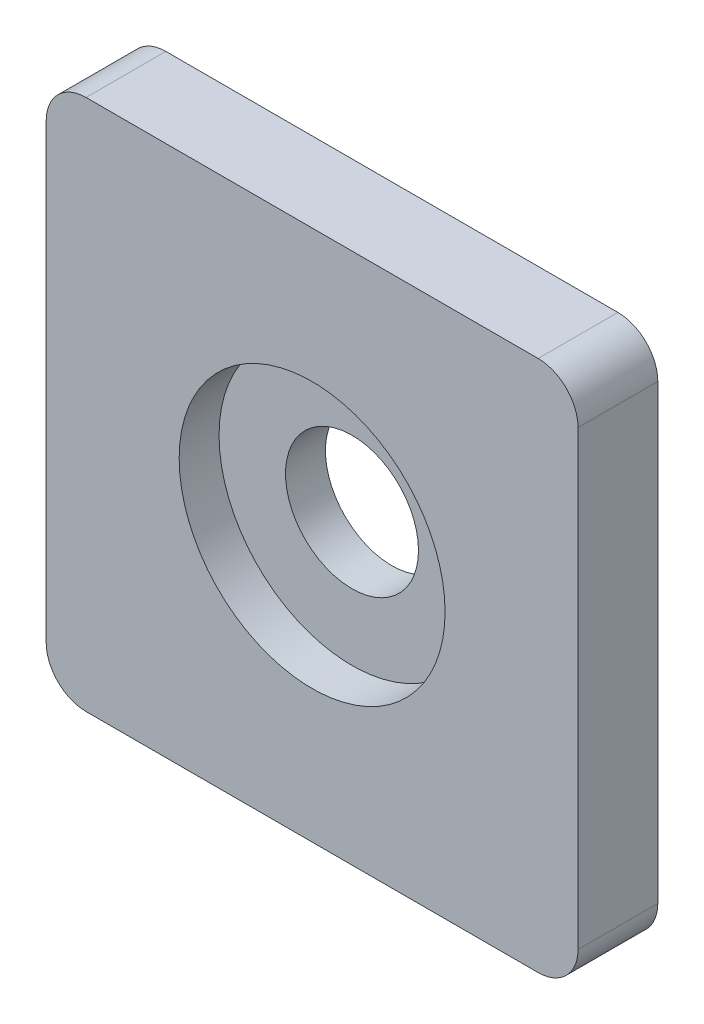
ISO-10303-21;
HEADER;
FILE_DESCRIPTION(('STEP AP214'),'2;1');
FILE_NAME('part.step','',(''),(''),'','','');
FILE_SCHEMA(('AUTOMOTIVE_DESIGN { 1 0 10303 214 1 1 1 1 }'));
ENDSEC;
DATA;
#1=APPLICATION_CONTEXT('core data for automotive mechanical design processes');
#2=APPLICATION_PROTOCOL_DEFINITION('international standard','automotive_design',2000,#1);
#3=PRODUCT_CONTEXT('',#1,'mechanical');
#4=PRODUCT('Part','Part','',(#3));
#5=PRODUCT_RELATED_PRODUCT_CATEGORY('part','',(#4));
#6=PRODUCT_DEFINITION_FORMATION('','',#4);
#7=PRODUCT_DEFINITION_CONTEXT('part definition',#1,'design');
#8=PRODUCT_DEFINITION('design','',#6,#7);
#9=PRODUCT_DEFINITION_SHAPE('','',#8);
#10=(LENGTH_UNIT() NAMED_UNIT(*) SI_UNIT(.MILLI.,.METRE.));
#11=(NAMED_UNIT(*) PLANE_ANGLE_UNIT() SI_UNIT($,.RADIAN.));
#12=(NAMED_UNIT(*) SI_UNIT($,.STERADIAN.) SOLID_ANGLE_UNIT());
#13=UNCERTAINTY_MEASURE_WITH_UNIT(LENGTH_MEASURE(1.E-05),#10,'distance_accuracy_value','');
#14=(GEOMETRIC_REPRESENTATION_CONTEXT(3) GLOBAL_UNCERTAINTY_ASSIGNED_CONTEXT((#13)) GLOBAL_UNIT_ASSIGNED_CONTEXT((#10,
#11,#12)) REPRESENTATION_CONTEXT('',''));
#15=CARTESIAN_POINT('',(0.,0.,0.));
#16=DIRECTION('',(0.,0.,1.));
#17=DIRECTION('',(1.,0.,0.));
#18=AXIS2_PLACEMENT_3D('',#15,#16,#17);
#19=CARTESIAN_POINT('',(0.,0.,1.5));
#20=DIRECTION('',(0.,0.,-1.));
#21=DIRECTION('',(-1.,0.,0.));
#22=AXIS2_PLACEMENT_3D('',#19,#20,#21);
#23=CYLINDRICAL_SURFACE('',#22,2.5);
#24=CARTESIAN_POINT('',(0.,0.,-1.5));
#25=DIRECTION('',(0.,0.,1.));
#26=DIRECTION('',(1.,0.,0.));
#27=AXIS2_PLACEMENT_3D('',#24,#25,#26);
#28=CIRCLE('',#27,2.5);
#29=CARTESIAN_POINT('',(2.5,0.,-1.5));
#30=VERTEX_POINT('',#29);
#31=EDGE_CURVE('E135',#30,#30,#28,.T.);
#32=ORIENTED_EDGE('',*,*,#31,.F.);
#33=EDGE_LOOP('',(#32));
#34=FACE_BOUND('',#33,.T.);
#35=CARTESIAN_POINT('',(0.,0.,0.));
#36=DIRECTION('',(0.,0.,1.));
#37=DIRECTION('',(1.,0.,0.));
#38=AXIS2_PLACEMENT_3D('',#35,#36,#37);
#39=CIRCLE('',#38,2.5);
#40=CARTESIAN_POINT('',(2.5,0.,0.));
#41=VERTEX_POINT('',#40);
#42=EDGE_CURVE('E37',#41,#41,#39,.T.);
#43=ORIENTED_EDGE('',*,*,#42,.T.);
#44=EDGE_LOOP('',(#43));
#45=FACE_BOUND('',#44,.T.);
#46=ADVANCED_FACE('F33',(#34,#45),#23,.F.);
#47=CARTESIAN_POINT('',(-8.50000000000001,-8.50000000000001,1.5));
#48=DIRECTION('',(0.,0.,-1.));
#49=DIRECTION('',(-1.,0.,0.));
#50=AXIS2_PLACEMENT_3D('',#47,#48,#49);
#51=PLANE('',#50);
#52=CARTESIAN_POINT('',(0.,0.,1.5));
#53=DIRECTION('',(0.,0.,1.));
#54=DIRECTION('',(1.,0.,0.));
#55=AXIS2_PLACEMENT_3D('',#52,#53,#54);
#56=CIRCLE('',#55,5.);
#57=CARTESIAN_POINT('',(4.99999999999999,0.,1.5));
#58=VERTEX_POINT('',#57);
#59=EDGE_CURVE('E186',#58,#58,#56,.T.);
#60=ORIENTED_EDGE('',*,*,#59,.F.);
#61=EDGE_LOOP('',(#60));
#62=FACE_BOUND('',#61,.T.);
#63=CARTESIAN_POINT('',(-8.50000000000001,-8.50000000000001,1.5));
#64=DIRECTION('',(0.,0.,1.));
#65=DIRECTION('',(-1.,0.,0.));
#66=AXIS2_PLACEMENT_3D('',#63,#64,#65);
#67=CIRCLE('',#66,1.5);
#68=CARTESIAN_POINT('',(-10.,-8.5,1.5));
#69=VERTEX_POINT('',#68);
#70=CARTESIAN_POINT('',(-8.5,-10.,1.5));
#71=VERTEX_POINT('',#70);
#72=EDGE_CURVE('E146',#69,#71,#67,.T.);
#73=ORIENTED_EDGE('',*,*,#72,.T.);
#74=DIRECTION('',(1.,0.,0.));
#75=VECTOR('',#74,1.);
#76=CARTESIAN_POINT('',(-8.5,-10.,1.5));
#77=LINE('',#76,#75);
#78=CARTESIAN_POINT('',(8.49999999999999,-10.,1.5));
#79=VERTEX_POINT('',#78);
#80=EDGE_CURVE('E94',#71,#79,#77,.T.);
#81=ORIENTED_EDGE('',*,*,#80,.T.);
#82=CARTESIAN_POINT('',(8.49999999999999,-8.5,1.5));
#83=DIRECTION('',(0.,0.,1.));
#84=DIRECTION('',(1.,0.,0.));
#85=AXIS2_PLACEMENT_3D('',#82,#83,#84);
#86=CIRCLE('',#85,1.5);
#87=CARTESIAN_POINT('',(9.99999999999999,-8.49999999999999,1.5));
#88=VERTEX_POINT('',#87);
#89=EDGE_CURVE('E162',#79,#88,#86,.T.);
#90=ORIENTED_EDGE('',*,*,#89,.T.);
#91=DIRECTION('',(0.,1.,0.));
#92=VECTOR('',#91,1.);
#93=CARTESIAN_POINT('',(9.99999999999999,-8.49999999999999,1.5));
#94=LINE('',#93,#92);
#95=CARTESIAN_POINT('',(9.99999999999999,8.49999999999999,1.5));
#96=VERTEX_POINT('',#95);
#97=EDGE_CURVE('E175',#88,#96,#94,.T.);
#98=ORIENTED_EDGE('',*,*,#97,.T.);
#99=CARTESIAN_POINT('',(8.49999999999999,8.49999999999999,1.5));
#100=DIRECTION('',(0.,0.,1.));
#101=DIRECTION('',(-1.,0.,0.));
#102=AXIS2_PLACEMENT_3D('',#99,#100,#101);
#103=CIRCLE('',#102,1.5);
#104=CARTESIAN_POINT('',(8.49999999999999,9.99999999999999,1.5));
#105=VERTEX_POINT('',#104);
#106=EDGE_CURVE('E113',#96,#105,#103,.T.);
#107=ORIENTED_EDGE('',*,*,#106,.T.);
#108=DIRECTION('',(-1.,0.,0.));
#109=VECTOR('',#108,1.);
#110=CARTESIAN_POINT('',(-8.5,9.99999999999999,1.5));
#111=LINE('',#110,#109);
#112=CARTESIAN_POINT('',(-8.5,9.99999999999999,1.5));
#113=VERTEX_POINT('',#112);
#114=EDGE_CURVE('E107',#105,#113,#111,.T.);
#115=ORIENTED_EDGE('',*,*,#114,.T.);
#116=CARTESIAN_POINT('',(-8.50000000000001,8.49999999999999,1.5));
#117=DIRECTION('',(0.,0.,1.));
#118=DIRECTION('',(-1.,0.,0.));
#119=AXIS2_PLACEMENT_3D('',#116,#117,#118);
#120=CIRCLE('',#119,1.5);
#121=CARTESIAN_POINT('',(-10.,8.49999999999999,1.5));
#122=VERTEX_POINT('',#121);
#123=EDGE_CURVE('E111',#113,#122,#120,.T.);
#124=ORIENTED_EDGE('',*,*,#123,.T.);
#125=DIRECTION('',(0.,-1.,0.));
#126=VECTOR('',#125,1.);
#127=CARTESIAN_POINT('',(-10.,-8.5,1.5));
#128=LINE('',#127,#126);
#129=EDGE_CURVE('E51',#122,#69,#128,.T.);
#130=ORIENTED_EDGE('',*,*,#129,.T.);
#131=EDGE_LOOP('',(#73,#81,#90,#98,#107,#115,#124,#130));
#132=FACE_BOUND('',#131,.T.);
#133=ADVANCED_FACE('F109',(#62,#132),#51,.F.);
#134=CARTESIAN_POINT('',(-8.50000000000001,-8.50000000000001,-1.5));
#135=DIRECTION('',(0.,0.,-1.));
#136=DIRECTION('',(-1.,0.,0.));
#137=AXIS2_PLACEMENT_3D('',#134,#135,#136);
#138=PLANE('',#137);
#139=CARTESIAN_POINT('',(-8.50000000000001,-8.50000000000001,-1.5));
#140=DIRECTION('',(0.,0.,1.));
#141=DIRECTION('',(-1.,0.,0.));
#142=AXIS2_PLACEMENT_3D('',#139,#140,#141);
#143=CIRCLE('',#142,1.5);
#144=CARTESIAN_POINT('',(-10.,-8.5,-1.5));
#145=VERTEX_POINT('',#144);
#146=CARTESIAN_POINT('',(-8.5,-10.,-1.5));
#147=VERTEX_POINT('',#146);
#148=EDGE_CURVE('E131',#145,#147,#143,.T.);
#149=ORIENTED_EDGE('',*,*,#148,.F.);
#150=DIRECTION('',(0.,-1.,0.));
#151=VECTOR('',#150,1.);
#152=CARTESIAN_POINT('',(-10.,-8.5,-1.5));
#153=LINE('',#152,#151);
#154=CARTESIAN_POINT('',(-10.,8.49999999999999,-1.5));
#155=VERTEX_POINT('',#154);
#156=EDGE_CURVE('E86',#155,#145,#153,.T.);
#157=ORIENTED_EDGE('',*,*,#156,.F.);
#158=CARTESIAN_POINT('',(-8.50000000000001,8.49999999999999,-1.5));
#159=DIRECTION('',(0.,0.,1.));
#160=DIRECTION('',(-1.,0.,0.));
#161=AXIS2_PLACEMENT_3D('',#158,#159,#160);
#162=CIRCLE('',#161,1.5);
#163=CARTESIAN_POINT('',(-8.5,9.99999999999999,-1.5));
#164=VERTEX_POINT('',#163);
#165=EDGE_CURVE('E80',#164,#155,#162,.T.);
#166=ORIENTED_EDGE('',*,*,#165,.F.);
#167=DIRECTION('',(-1.,0.,0.));
#168=VECTOR('',#167,1.);
#169=CARTESIAN_POINT('',(-8.5,9.99999999999999,-1.5));
#170=LINE('',#169,#168);
#171=CARTESIAN_POINT('',(8.49999999999999,9.99999999999999,-1.5));
#172=VERTEX_POINT('',#171);
#173=EDGE_CURVE('E121',#172,#164,#170,.T.);
#174=ORIENTED_EDGE('',*,*,#173,.F.);
#175=CARTESIAN_POINT('',(8.49999999999999,8.49999999999999,-1.5));
#176=DIRECTION('',(0.,0.,1.));
#177=DIRECTION('',(-1.,0.,0.));
#178=AXIS2_PLACEMENT_3D('',#175,#176,#177);
#179=CIRCLE('',#178,1.5);
#180=CARTESIAN_POINT('',(9.99999999999999,8.49999999999999,-1.5));
#181=VERTEX_POINT('',#180);
#182=EDGE_CURVE('E141',#181,#172,#179,.T.);
#183=ORIENTED_EDGE('',*,*,#182,.F.);
#184=DIRECTION('',(0.,1.,0.));
#185=VECTOR('',#184,1.);
#186=CARTESIAN_POINT('',(9.99999999999999,-8.49999999999999,-1.5));
#187=LINE('',#186,#185);
#188=CARTESIAN_POINT('',(9.99999999999999,-8.49999999999999,-1.5));
#189=VERTEX_POINT('',#188);
#190=EDGE_CURVE('E139',#189,#181,#187,.T.);
#191=ORIENTED_EDGE('',*,*,#190,.F.);
#192=CARTESIAN_POINT('',(8.49999999999999,-8.5,-1.5));
#193=DIRECTION('',(0.,0.,1.));
#194=DIRECTION('',(1.,0.,0.));
#195=AXIS2_PLACEMENT_3D('',#192,#193,#194);
#196=CIRCLE('',#195,1.5);
#197=CARTESIAN_POINT('',(8.49999999999999,-10.,-1.5));
#198=VERTEX_POINT('',#197);
#199=EDGE_CURVE('E137',#198,#189,#196,.T.);
#200=ORIENTED_EDGE('',*,*,#199,.F.);
#201=DIRECTION('',(1.,0.,0.));
#202=VECTOR('',#201,1.);
#203=CARTESIAN_POINT('',(-8.5,-10.,-1.5));
#204=LINE('',#203,#202);
#205=EDGE_CURVE('E134',#147,#198,#204,.T.);
#206=ORIENTED_EDGE('',*,*,#205,.F.);
#207=EDGE_LOOP('',(#149,#157,#166,#174,#183,#191,#200,#206));
#208=FACE_BOUND('',#207,.T.);
#209=ORIENTED_EDGE('',*,*,#31,.T.);
#210=EDGE_LOOP('',(#209));
#211=FACE_BOUND('',#210,.T.);
#212=ADVANCED_FACE('F166',(#208,#211),#138,.T.);
#213=CARTESIAN_POINT('',(-8.50000000000001,-8.50000000000001,1.5));
#214=DIRECTION('',(0.,0.,-1.));
#215=DIRECTION('',(-1.,0.,0.));
#216=AXIS2_PLACEMENT_3D('',#213,#214,#215);
#217=CYLINDRICAL_SURFACE('',#216,1.5);
#218=ORIENTED_EDGE('',*,*,#148,.T.);
#219=DIRECTION('',(0.,0.,-1.));
#220=VECTOR('',#219,1.);
#221=CARTESIAN_POINT('',(-8.5,-10.,1.5));
#222=LINE('',#221,#220);
#223=EDGE_CURVE('E11',#71,#147,#222,.T.);
#224=ORIENTED_EDGE('',*,*,#223,.F.);
#225=ORIENTED_EDGE('',*,*,#72,.F.);
#226=DIRECTION('',(0.,0.,-1.));
#227=VECTOR('',#226,1.);
#228=CARTESIAN_POINT('',(-10.,-8.5,1.5));
#229=LINE('',#228,#227);
#230=EDGE_CURVE('E127',#69,#145,#229,.T.);
#231=ORIENTED_EDGE('',*,*,#230,.T.);
#232=EDGE_LOOP('',(#218,#224,#225,#231));
#233=FACE_BOUND('',#232,.T.);
#234=ADVANCED_FACE('F35',(#233),#217,.T.);
#235=CARTESIAN_POINT('',(-8.5,-10.,1.5));
#236=DIRECTION('',(0.,1.,0.));
#237=DIRECTION('',(-1.,0.,0.));
#238=AXIS2_PLACEMENT_3D('',#235,#236,#237);
#239=PLANE('',#238);
#240=ORIENTED_EDGE('',*,*,#205,.T.);
#241=DIRECTION('',(0.,0.,-1.));
#242=VECTOR('',#241,1.);
#243=CARTESIAN_POINT('',(8.49999999999999,-10.,1.5));
#244=LINE('',#243,#242);
#245=EDGE_CURVE('E43',#79,#198,#244,.T.);
#246=ORIENTED_EDGE('',*,*,#245,.F.);
#247=ORIENTED_EDGE('',*,*,#80,.F.);
#248=ORIENTED_EDGE('',*,*,#223,.T.);
#249=EDGE_LOOP('',(#240,#246,#247,#248));
#250=FACE_BOUND('',#249,.T.);
#251=ADVANCED_FACE('F215',(#250),#239,.F.);
#252=CARTESIAN_POINT('',(8.49999999999999,-8.5,1.5));
#253=DIRECTION('',(0.,0.,-1.));
#254=DIRECTION('',(-1.,0.,0.));
#255=AXIS2_PLACEMENT_3D('',#252,#253,#254);
#256=CYLINDRICAL_SURFACE('',#255,1.5);
#257=ORIENTED_EDGE('',*,*,#199,.T.);
#258=DIRECTION('',(0.,0.,-1.));
#259=VECTOR('',#258,1.);
#260=CARTESIAN_POINT('',(9.99999999999999,-8.49999999999999,1.5));
#261=LINE('',#260,#259);
#262=EDGE_CURVE('E153',#88,#189,#261,.T.);
#263=ORIENTED_EDGE('',*,*,#262,.F.);
#264=ORIENTED_EDGE('',*,*,#89,.F.);
#265=ORIENTED_EDGE('',*,*,#245,.T.);
#266=EDGE_LOOP('',(#257,#263,#264,#265));
#267=FACE_BOUND('',#266,.T.);
#268=ADVANCED_FACE('F160',(#267),#256,.T.);
#269=CARTESIAN_POINT('',(9.99999999999999,-8.49999999999999,1.5));
#270=DIRECTION('',(-1.,0.,0.));
#271=DIRECTION('',(0.,0.,1.));
#272=AXIS2_PLACEMENT_3D('',#269,#270,#271);
#273=PLANE('',#272);
#274=ORIENTED_EDGE('',*,*,#190,.T.);
#275=DIRECTION('',(0.,0.,-1.));
#276=VECTOR('',#275,1.);
#277=CARTESIAN_POINT('',(9.99999999999999,8.49999999999999,1.5));
#278=LINE('',#277,#276);
#279=EDGE_CURVE('E150',#96,#181,#278,.T.);
#280=ORIENTED_EDGE('',*,*,#279,.F.);
#281=ORIENTED_EDGE('',*,*,#97,.F.);
#282=ORIENTED_EDGE('',*,*,#262,.T.);
#283=EDGE_LOOP('',(#274,#280,#281,#282));
#284=FACE_BOUND('',#283,.T.);
#285=ADVANCED_FACE('F171',(#284),#273,.F.);
#286=CARTESIAN_POINT('',(8.49999999999999,8.49999999999999,1.5));
#287=DIRECTION('',(0.,0.,-1.));
#288=DIRECTION('',(-1.,0.,0.));
#289=AXIS2_PLACEMENT_3D('',#286,#287,#288);
#290=CYLINDRICAL_SURFACE('',#289,1.5);
#291=ORIENTED_EDGE('',*,*,#182,.T.);
#292=DIRECTION('',(0.,0.,-1.));
#293=VECTOR('',#292,1.);
#294=CARTESIAN_POINT('',(8.49999999999999,9.99999999999999,1.5));
#295=LINE('',#294,#293);
#296=EDGE_CURVE('E122',#105,#172,#295,.T.);
#297=ORIENTED_EDGE('',*,*,#296,.F.);
#298=ORIENTED_EDGE('',*,*,#106,.F.);
#299=ORIENTED_EDGE('',*,*,#279,.T.);
#300=EDGE_LOOP('',(#291,#297,#298,#299));
#301=FACE_BOUND('',#300,.T.);
#302=ADVANCED_FACE('F174',(#301),#290,.T.);
#303=CARTESIAN_POINT('',(-8.5,9.99999999999999,1.5));
#304=DIRECTION('',(0.,-1.,0.));
#305=DIRECTION('',(0.,0.,-1.));
#306=AXIS2_PLACEMENT_3D('',#303,#304,#305);
#307=PLANE('',#306);
#308=ORIENTED_EDGE('',*,*,#173,.T.);
#309=DIRECTION('',(0.,0.,-1.));
#310=VECTOR('',#309,1.);
#311=CARTESIAN_POINT('',(-8.5,9.99999999999999,1.5));
#312=LINE('',#311,#310);
#313=EDGE_CURVE('E118',#113,#164,#312,.T.);
#314=ORIENTED_EDGE('',*,*,#313,.F.);
#315=ORIENTED_EDGE('',*,*,#114,.F.);
#316=ORIENTED_EDGE('',*,*,#296,.T.);
#317=EDGE_LOOP('',(#308,#314,#315,#316));
#318=FACE_BOUND('',#317,.T.);
#319=ADVANCED_FACE('F119',(#318),#307,.F.);
#320=CARTESIAN_POINT('',(-8.50000000000001,8.49999999999999,1.5));
#321=DIRECTION('',(0.,0.,-1.));
#322=DIRECTION('',(-1.,0.,0.));
#323=AXIS2_PLACEMENT_3D('',#320,#321,#322);
#324=CYLINDRICAL_SURFACE('',#323,1.5);
#325=ORIENTED_EDGE('',*,*,#165,.T.);
#326=DIRECTION('',(0.,0.,-1.));
#327=VECTOR('',#326,1.);
#328=CARTESIAN_POINT('',(-10.,8.49999999999999,1.5));
#329=LINE('',#328,#327);
#330=EDGE_CURVE('E123',#122,#155,#329,.T.);
#331=ORIENTED_EDGE('',*,*,#330,.F.);
#332=ORIENTED_EDGE('',*,*,#123,.F.);
#333=ORIENTED_EDGE('',*,*,#313,.T.);
#334=EDGE_LOOP('',(#325,#331,#332,#333));
#335=FACE_BOUND('',#334,.T.);
#336=ADVANCED_FACE('F125',(#335),#324,.T.);
#337=CARTESIAN_POINT('',(-10.,-8.5,1.5));
#338=DIRECTION('',(1.,0.,0.));
#339=DIRECTION('',(0.,0.,-1.));
#340=AXIS2_PLACEMENT_3D('',#337,#338,#339);
#341=PLANE('',#340);
#342=ORIENTED_EDGE('',*,*,#156,.T.);
#343=ORIENTED_EDGE('',*,*,#230,.F.);
#344=ORIENTED_EDGE('',*,*,#129,.F.);
#345=ORIENTED_EDGE('',*,*,#330,.T.);
#346=EDGE_LOOP('',(#342,#343,#344,#345));
#347=FACE_BOUND('',#346,.T.);
#348=ADVANCED_FACE('F203',(#347),#341,.F.);
#349=CARTESIAN_POINT('',(0.,0.,-14.142135623731));
#350=DIRECTION('',(0.,0.,1.));
#351=DIRECTION('',(1.,0.,0.));
#352=AXIS2_PLACEMENT_3D('',#349,#350,#351);
#353=CYLINDRICAL_SURFACE('',#352,5.);
#354=CARTESIAN_POINT('',(0.,0.,0.));
#355=DIRECTION('',(0.,0.,1.));
#356=DIRECTION('',(1.,0.,0.));
#357=AXIS2_PLACEMENT_3D('',#354,#355,#356);
#358=CIRCLE('',#357,5.);
#359=CARTESIAN_POINT('',(4.99999999999999,0.,0.));
#360=VERTEX_POINT('',#359);
#361=EDGE_CURVE('E183',#360,#360,#358,.F.);
#362=ORIENTED_EDGE('',*,*,#361,.T.);
#363=EDGE_LOOP('',(#362));
#364=FACE_BOUND('',#363,.T.);
#365=ORIENTED_EDGE('',*,*,#59,.T.);
#366=EDGE_LOOP('',(#365));
#367=FACE_BOUND('',#366,.T.);
#368=ADVANCED_FACE('F190',(#364,#367),#353,.F.);
#369=CARTESIAN_POINT('',(0.,0.,0.));
#370=DIRECTION('',(0.,0.,1.));
#371=DIRECTION('',(1.,0.,0.));
#372=AXIS2_PLACEMENT_3D('',#369,#370,#371);
#373=PLANE('',#372);
#374=ORIENTED_EDGE('',*,*,#42,.F.);
#375=EDGE_LOOP('',(#374));
#376=FACE_BOUND('',#375,.T.);
#377=ORIENTED_EDGE('',*,*,#361,.F.);
#378=EDGE_LOOP('',(#377));
#379=FACE_BOUND('',#378,.T.);
#380=ADVANCED_FACE('F283',(#376,#379),#373,.T.);
#381=CLOSED_SHELL('',(#46,#133,#212,#234,#251,#268,#285,#302,#319,#336,#348,#368,#380));
#382=MANIFOLD_SOLID_BREP('B2',#381);
#383=ADVANCED_BREP_SHAPE_REPRESENTATION('',(#18,#382),#14);
#384=SHAPE_DEFINITION_REPRESENTATION(#9,#383);
ENDSEC;
END-ISO-10303-21;
